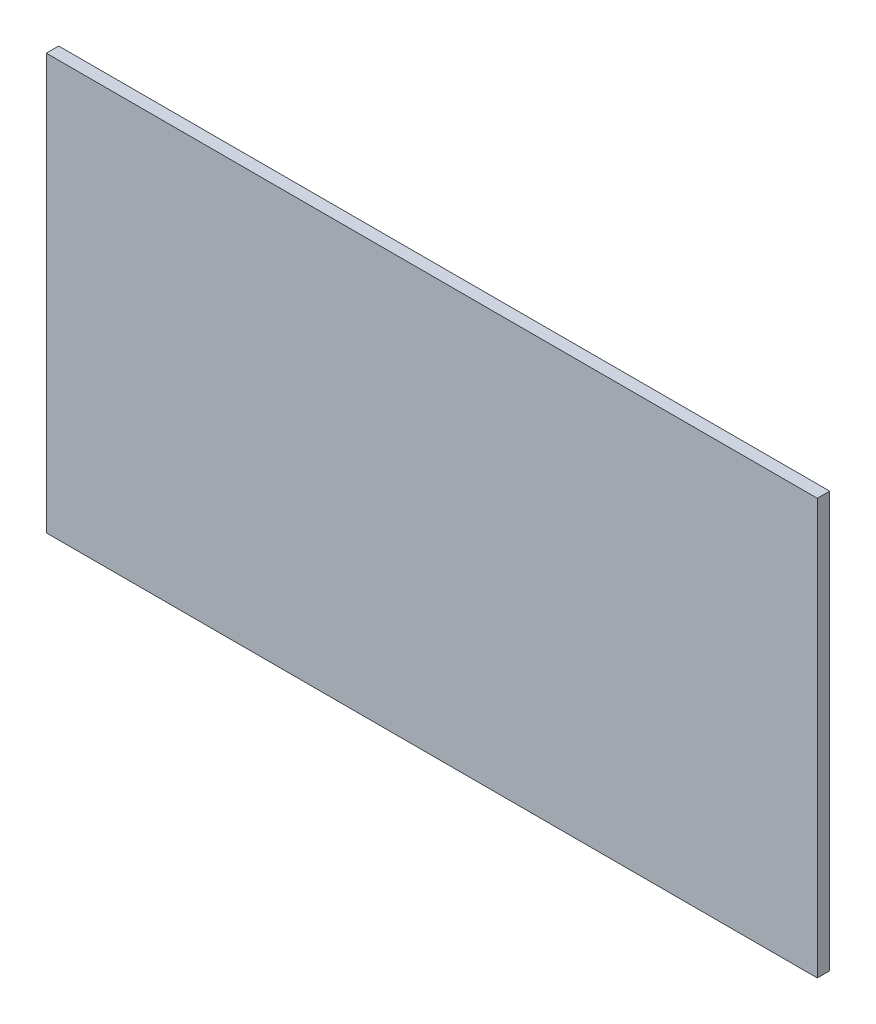
ISO-10303-21;
HEADER;
FILE_DESCRIPTION(('STEP AP214'),'2;1');
FILE_NAME('part.step','',(''),(''),'','','');
FILE_SCHEMA(('AUTOMOTIVE_DESIGN { 1 0 10303 214 1 1 1 1 }'));
ENDSEC;
DATA;
#1=APPLICATION_CONTEXT('core data for automotive mechanical design processes');
#2=APPLICATION_PROTOCOL_DEFINITION('international standard','automotive_design',2000,#1);
#3=PRODUCT_CONTEXT('',#1,'mechanical');
#4=PRODUCT('Part','Part','',(#3));
#5=PRODUCT_RELATED_PRODUCT_CATEGORY('part','',(#4));
#6=PRODUCT_DEFINITION_FORMATION('','',#4);
#7=PRODUCT_DEFINITION_CONTEXT('part definition',#1,'design');
#8=PRODUCT_DEFINITION('design','',#6,#7);
#9=PRODUCT_DEFINITION_SHAPE('','',#8);
#10=(LENGTH_UNIT() NAMED_UNIT(*) SI_UNIT(.MILLI.,.METRE.));
#11=(NAMED_UNIT(*) PLANE_ANGLE_UNIT() SI_UNIT($,.RADIAN.));
#12=(NAMED_UNIT(*) SI_UNIT($,.STERADIAN.) SOLID_ANGLE_UNIT());
#13=UNCERTAINTY_MEASURE_WITH_UNIT(LENGTH_MEASURE(1.E-05),#10,'distance_accuracy_value','');
#14=(GEOMETRIC_REPRESENTATION_CONTEXT(3) GLOBAL_UNCERTAINTY_ASSIGNED_CONTEXT((#13)) GLOBAL_UNIT_ASSIGNED_CONTEXT((#10,
#11,#12)) REPRESENTATION_CONTEXT('',''));
#15=CARTESIAN_POINT('',(0.,0.,0.));
#16=DIRECTION('',(0.,0.,1.));
#17=DIRECTION('',(1.,0.,0.));
#18=AXIS2_PLACEMENT_3D('',#15,#16,#17);
#19=CARTESIAN_POINT('',(0.,-177.066974547161,10.));
#20=DIRECTION('',(0.,-1.,0.));
#21=DIRECTION('',(0.,0.,-1.));
#22=AXIS2_PLACEMENT_3D('',#19,#20,#21);
#23=PLANE('',#22);
#24=DIRECTION('',(-1.,0.,0.));
#25=VECTOR('',#24,1.);
#26=CARTESIAN_POINT('',(0.,-177.066974547161,0.));
#27=LINE('',#26,#25);
#28=CARTESIAN_POINT('',(307.181662281048,-177.066974547161,0.));
#29=VERTEX_POINT('',#28);
#30=CARTESIAN_POINT('',(-315.047879452851,-177.066974547161,0.));
#31=VERTEX_POINT('',#30);
#32=EDGE_CURVE('E107',#29,#31,#27,.T.);
#33=ORIENTED_EDGE('',*,*,#32,.F.);
#34=DIRECTION('',(0.,0.,-1.));
#35=VECTOR('',#34,1.);
#36=CARTESIAN_POINT('',(307.181662281048,-177.066974547161,10.));
#37=LINE('',#36,#35);
#38=CARTESIAN_POINT('',(307.181662281048,-177.066974547161,10.));
#39=VERTEX_POINT('',#38);
#40=EDGE_CURVE('E11',#39,#29,#37,.T.);
#41=ORIENTED_EDGE('',*,*,#40,.F.);
#42=DIRECTION('',(-1.,0.,0.));
#43=VECTOR('',#42,1.);
#44=CARTESIAN_POINT('',(0.,-177.066974547161,10.));
#45=LINE('',#44,#43);
#46=CARTESIAN_POINT('',(-315.047879452851,-177.066974547161,10.));
#47=VERTEX_POINT('',#46);
#48=EDGE_CURVE('E96',#39,#47,#45,.T.);
#49=ORIENTED_EDGE('',*,*,#48,.T.);
#50=DIRECTION('',(0.,0.,-1.));
#51=VECTOR('',#50,1.);
#52=CARTESIAN_POINT('',(-315.047879452851,-177.066974547161,10.));
#53=LINE('',#52,#51);
#54=EDGE_CURVE('E56',#47,#31,#53,.T.);
#55=ORIENTED_EDGE('',*,*,#54,.T.);
#56=EDGE_LOOP('',(#33,#41,#49,#55));
#57=FACE_BOUND('',#56,.T.);
#58=ADVANCED_FACE('F39',(#57),#23,.T.);
#59=CARTESIAN_POINT('',(307.181662281048,0.,10.));
#60=DIRECTION('',(1.,0.,0.));
#61=DIRECTION('',(0.,0.,-1.));
#62=AXIS2_PLACEMENT_3D('',#59,#60,#61);
#63=PLANE('',#62);
#64=DIRECTION('',(0.,-1.,0.));
#65=VECTOR('',#64,1.);
#66=CARTESIAN_POINT('',(307.181662281048,0.,0.));
#67=LINE('',#66,#65);
#68=CARTESIAN_POINT('',(307.181662281048,158.213025452839,0.));
#69=VERTEX_POINT('',#68);
#70=EDGE_CURVE('E86',#69,#29,#67,.T.);
#71=ORIENTED_EDGE('',*,*,#70,.F.);
#72=DIRECTION('',(0.,0.,-1.));
#73=VECTOR('',#72,1.);
#74=CARTESIAN_POINT('',(307.181662281048,158.213025452839,10.));
#75=LINE('',#74,#73);
#76=CARTESIAN_POINT('',(307.181662281048,158.213025452839,10.));
#77=VERTEX_POINT('',#76);
#78=EDGE_CURVE('E48',#77,#69,#75,.T.);
#79=ORIENTED_EDGE('',*,*,#78,.F.);
#80=DIRECTION('',(0.,-1.,0.));
#81=VECTOR('',#80,1.);
#82=CARTESIAN_POINT('',(307.181662281048,0.,10.));
#83=LINE('',#82,#81);
#84=EDGE_CURVE('E84',#77,#39,#83,.T.);
#85=ORIENTED_EDGE('',*,*,#84,.T.);
#86=ORIENTED_EDGE('',*,*,#40,.T.);
#87=EDGE_LOOP('',(#71,#79,#85,#86));
#88=FACE_BOUND('',#87,.T.);
#89=ADVANCED_FACE('F83',(#88),#63,.T.);
#90=CARTESIAN_POINT('',(0.,158.213025452839,10.));
#91=DIRECTION('',(0.,1.,0.));
#92=DIRECTION('',(0.,0.,1.));
#93=AXIS2_PLACEMENT_3D('',#90,#91,#92);
#94=PLANE('',#93);
#95=DIRECTION('',(1.,0.,0.));
#96=VECTOR('',#95,1.);
#97=CARTESIAN_POINT('',(0.,158.213025452839,0.));
#98=LINE('',#97,#96);
#99=CARTESIAN_POINT('',(-315.047879452851,158.213025452839,0.));
#100=VERTEX_POINT('',#99);
#101=EDGE_CURVE('E112',#100,#69,#98,.T.);
#102=ORIENTED_EDGE('',*,*,#101,.F.);
#103=DIRECTION('',(0.,0.,-1.));
#104=VECTOR('',#103,1.);
#105=CARTESIAN_POINT('',(-315.047879452851,158.213025452839,10.));
#106=LINE('',#105,#104);
#107=CARTESIAN_POINT('',(-315.047879452851,158.213025452839,10.));
#108=VERTEX_POINT('',#107);
#109=EDGE_CURVE('E69',#108,#100,#106,.T.);
#110=ORIENTED_EDGE('',*,*,#109,.F.);
#111=DIRECTION('',(1.,0.,0.));
#112=VECTOR('',#111,1.);
#113=CARTESIAN_POINT('',(0.,158.213025452839,10.));
#114=LINE('',#113,#112);
#115=EDGE_CURVE('E95',#108,#77,#114,.T.);
#116=ORIENTED_EDGE('',*,*,#115,.T.);
#117=ORIENTED_EDGE('',*,*,#78,.T.);
#118=EDGE_LOOP('',(#102,#110,#116,#117));
#119=FACE_BOUND('',#118,.T.);
#120=ADVANCED_FACE('F99',(#119),#94,.T.);
#121=CARTESIAN_POINT('',(-315.047879452851,0.,10.));
#122=DIRECTION('',(-1.,0.,0.));
#123=DIRECTION('',(0.,0.,1.));
#124=AXIS2_PLACEMENT_3D('',#121,#122,#123);
#125=PLANE('',#124);
#126=DIRECTION('',(0.,1.,0.));
#127=VECTOR('',#126,1.);
#128=CARTESIAN_POINT('',(-315.047879452851,0.,0.));
#129=LINE('',#128,#127);
#130=EDGE_CURVE('E115',#31,#100,#129,.T.);
#131=ORIENTED_EDGE('',*,*,#130,.F.);
#132=ORIENTED_EDGE('',*,*,#54,.F.);
#133=DIRECTION('',(0.,1.,0.));
#134=VECTOR('',#133,1.);
#135=CARTESIAN_POINT('',(-315.047879452851,0.,10.));
#136=LINE('',#135,#134);
#137=EDGE_CURVE('E101',#47,#108,#136,.T.);
#138=ORIENTED_EDGE('',*,*,#137,.T.);
#139=ORIENTED_EDGE('',*,*,#109,.T.);
#140=EDGE_LOOP('',(#131,#132,#138,#139));
#141=FACE_BOUND('',#140,.T.);
#142=ADVANCED_FACE('F124',(#141),#125,.T.);
#143=CARTESIAN_POINT('',(0.,0.,10.));
#144=DIRECTION('',(0.,0.,1.));
#145=DIRECTION('',(1.,0.,0.));
#146=AXIS2_PLACEMENT_3D('',#143,#144,#145);
#147=PLANE('',#146);
#148=ORIENTED_EDGE('',*,*,#48,.F.);
#149=ORIENTED_EDGE('',*,*,#84,.F.);
#150=ORIENTED_EDGE('',*,*,#115,.F.);
#151=ORIENTED_EDGE('',*,*,#137,.F.);
#152=EDGE_LOOP('',(#148,#149,#150,#151));
#153=FACE_BOUND('',#152,.T.);
#154=ADVANCED_FACE('F93',(#153),#147,.T.);
#155=CARTESIAN_POINT('',(0.,0.,0.));
#156=DIRECTION('',(0.,0.,1.));
#157=DIRECTION('',(1.,0.,0.));
#158=AXIS2_PLACEMENT_3D('',#155,#156,#157);
#159=PLANE('',#158);
#160=ORIENTED_EDGE('',*,*,#32,.T.);
#161=ORIENTED_EDGE('',*,*,#130,.T.);
#162=ORIENTED_EDGE('',*,*,#101,.T.);
#163=ORIENTED_EDGE('',*,*,#70,.T.);
#164=EDGE_LOOP('',(#160,#161,#162,#163));
#165=FACE_BOUND('',#164,.T.);
#166=ADVANCED_FACE('F131',(#165),#159,.F.);
#167=CLOSED_SHELL('',(#58,#89,#120,#142,#154,#166));
#168=MANIFOLD_SOLID_BREP('B2',#167);
#169=ADVANCED_BREP_SHAPE_REPRESENTATION('',(#18,#168),#14);
#170=SHAPE_DEFINITION_REPRESENTATION(#9,#169);
ENDSEC;
END-ISO-10303-21;
